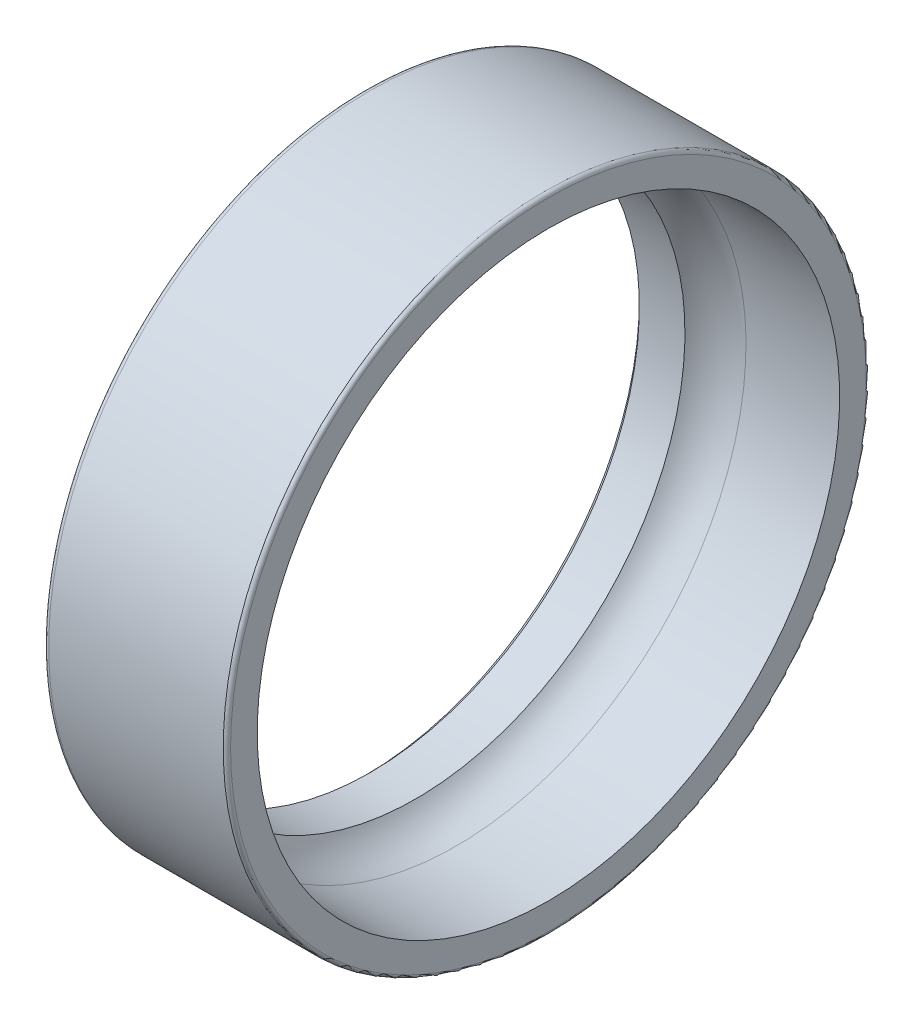
ISO-10303-21;
HEADER;
FILE_DESCRIPTION(('STEP AP214'),'2;1');
FILE_NAME('part.step','',(''),(''),'','','');
FILE_SCHEMA(('AUTOMOTIVE_DESIGN { 1 0 10303 214 1 1 1 1 }'));
ENDSEC;
DATA;
#1=APPLICATION_CONTEXT('core data for automotive mechanical design processes');
#2=APPLICATION_PROTOCOL_DEFINITION('international standard','automotive_design',2000,#1);
#3=PRODUCT_CONTEXT('',#1,'mechanical');
#4=PRODUCT('Part','Part','',(#3));
#5=PRODUCT_RELATED_PRODUCT_CATEGORY('part','',(#4));
#6=PRODUCT_DEFINITION_FORMATION('','',#4);
#7=PRODUCT_DEFINITION_CONTEXT('part definition',#1,'design');
#8=PRODUCT_DEFINITION('design','',#6,#7);
#9=PRODUCT_DEFINITION_SHAPE('','',#8);
#10=(LENGTH_UNIT() NAMED_UNIT(*) SI_UNIT(.MILLI.,.METRE.));
#11=(NAMED_UNIT(*) PLANE_ANGLE_UNIT() SI_UNIT($,.RADIAN.));
#12=(NAMED_UNIT(*) SI_UNIT($,.STERADIAN.) SOLID_ANGLE_UNIT());
#13=UNCERTAINTY_MEASURE_WITH_UNIT(LENGTH_MEASURE(1.E-05),#10,'distance_accuracy_value','');
#14=(GEOMETRIC_REPRESENTATION_CONTEXT(3) GLOBAL_UNCERTAINTY_ASSIGNED_CONTEXT((#13)) GLOBAL_UNIT_ASSIGNED_CONTEXT((#10,
#11,#12)) REPRESENTATION_CONTEXT('',''));
#15=CARTESIAN_POINT('',(0.,0.,0.));
#16=DIRECTION('',(0.,0.,1.));
#17=DIRECTION('',(1.,0.,0.));
#18=AXIS2_PLACEMENT_3D('',#15,#16,#17);
#19=CARTESIAN_POINT('',(0.,16.075,0.));
#20=DIRECTION('',(-1.,0.,0.));
#21=DIRECTION('',(0.,1.,0.));
#22=AXIS2_PLACEMENT_3D('',#19,#20,#21);
#23=PLANE('',#22);
#24=CARTESIAN_POINT('',(0.,0.,0.));
#25=DIRECTION('',(1.,0.,0.));
#26=DIRECTION('',(0.,1.,0.));
#27=AXIS2_PLACEMENT_3D('',#24,#25,#26);
#28=CIRCLE('',#27,14.95);
#29=CARTESIAN_POINT('',(0.,-14.95,0.));
#30=VERTEX_POINT('',#29);
#31=EDGE_CURVE('E86',#30,#30,#28,.T.);
#32=ORIENTED_EDGE('',*,*,#31,.T.);
#33=EDGE_LOOP('',(#32));
#34=FACE_BOUND('',#33,.T.);
#35=CARTESIAN_POINT('',(0.,0.,0.));
#36=DIRECTION('',(1.,0.,0.));
#37=DIRECTION('',(0.,1.,0.));
#38=AXIS2_PLACEMENT_3D('',#35,#36,#37);
#39=CIRCLE('',#38,17.2);
#40=CARTESIAN_POINT('',(0.,0.,17.2));
#41=VERTEX_POINT('',#40);
#42=EDGE_CURVE('E72',#41,#41,#39,.T.);
#43=ORIENTED_EDGE('',*,*,#42,.F.);
#44=EDGE_LOOP('',(#43));
#45=FACE_BOUND('',#44,.T.);
#46=ADVANCED_FACE('F17',(#34,#45),#23,.T.);
#47=CARTESIAN_POINT('',(10.,16.575,0.));
#48=DIRECTION('',(1.,0.,0.));
#49=DIRECTION('',(0.,1.,0.));
#50=AXIS2_PLACEMENT_3D('',#47,#48,#49);
#51=PLANE('',#50);
#52=CARTESIAN_POINT('',(10.,0.,0.));
#53=DIRECTION('',(1.,0.,0.));
#54=DIRECTION('',(0.,1.,0.));
#55=AXIS2_PLACEMENT_3D('',#52,#53,#54);
#56=CIRCLE('',#55,15.85);
#57=CARTESIAN_POINT('',(10.,-15.85,0.));
#58=VERTEX_POINT('',#57);
#59=EDGE_CURVE('E80',#58,#58,#56,.T.);
#60=ORIENTED_EDGE('',*,*,#59,.F.);
#61=EDGE_LOOP('',(#60));
#62=FACE_BOUND('',#61,.T.);
#63=CARTESIAN_POINT('',(10.,0.,0.));
#64=DIRECTION('',(1.,0.,0.));
#65=DIRECTION('',(0.,1.,0.));
#66=AXIS2_PLACEMENT_3D('',#63,#64,#65);
#67=CIRCLE('',#66,17.3);
#68=CARTESIAN_POINT('',(10.,0.,17.3));
#69=VERTEX_POINT('',#68);
#70=EDGE_CURVE('E27',#69,#69,#67,.T.);
#71=ORIENTED_EDGE('',*,*,#70,.T.);
#72=EDGE_LOOP('',(#71));
#73=FACE_BOUND('',#72,.T.);
#74=ADVANCED_FACE('F114',(#62,#73),#51,.T.);
#75=CARTESIAN_POINT('',(5.05,0.,0.));
#76=DIRECTION('',(1.,0.,0.));
#77=DIRECTION('',(0.,1.,0.));
#78=AXIS2_PLACEMENT_3D('',#75,#76,#77);
#79=CYLINDRICAL_SURFACE('',#78,17.5);
#80=CARTESIAN_POINT('',(0.3,0.,0.));
#81=DIRECTION('',(1.,0.,0.));
#82=DIRECTION('',(0.,1.,0.));
#83=AXIS2_PLACEMENT_3D('',#80,#81,#82);
#84=CIRCLE('',#83,17.5);
#85=CARTESIAN_POINT('',(0.3,-17.5,0.));
#86=VERTEX_POINT('',#85);
#87=EDGE_CURVE('E67',#86,#86,#84,.T.);
#88=ORIENTED_EDGE('',*,*,#87,.T.);
#89=EDGE_LOOP('',(#88));
#90=FACE_BOUND('',#89,.T.);
#91=CARTESIAN_POINT('',(9.8,0.,0.));
#92=DIRECTION('',(1.,0.,0.));
#93=DIRECTION('',(0.,1.,0.));
#94=AXIS2_PLACEMENT_3D('',#91,#92,#93);
#95=CIRCLE('',#94,17.5);
#96=CARTESIAN_POINT('',(9.8,-17.5,0.));
#97=VERTEX_POINT('',#96);
#98=EDGE_CURVE('E11',#97,#97,#95,.T.);
#99=ORIENTED_EDGE('',*,*,#98,.F.);
#100=EDGE_LOOP('',(#99));
#101=FACE_BOUND('',#100,.T.);
#102=ADVANCED_FACE('F68',(#90,#101),#79,.T.);
#103=CARTESIAN_POINT('',(9.8,0.,0.));
#104=DIRECTION('',(1.,0.,0.));
#105=DIRECTION('',(0.,0.,-1.));
#106=AXIS2_PLACEMENT_3D('',#103,#104,#105);
#107=TOROIDAL_SURFACE('',#106,17.3,0.2);
#108=ORIENTED_EDGE('',*,*,#98,.T.);
#109=EDGE_LOOP('',(#108));
#110=FACE_BOUND('',#109,.T.);
#111=ORIENTED_EDGE('',*,*,#70,.F.);
#112=EDGE_LOOP('',(#111));
#113=FACE_BOUND('',#112,.T.);
#114=ADVANCED_FACE('F109',(#110,#113),#107,.T.);
#115=CARTESIAN_POINT('',(7.48834401779462,0.,0.));
#116=DIRECTION('',(1.,0.,0.));
#117=DIRECTION('',(0.,1.,0.));
#118=AXIS2_PLACEMENT_3D('',#115,#116,#117);
#119=CONICAL_SURFACE('',#118,15.8138562022594,0.0143894320593544);
#120=CARTESIAN_POINT('',(4.97668803558923,0.,0.));
#121=DIRECTION('',(1.,0.,0.));
#122=DIRECTION('',(0.,1.,0.));
#123=AXIS2_PLACEMENT_3D('',#120,#121,#122);
#124=CIRCLE('',#123,15.7777124045187);
#125=CARTESIAN_POINT('',(4.97668803558923,15.7777124045187,0.));
#126=VERTEX_POINT('',#125);
#127=EDGE_CURVE('E82',#126,#126,#124,.T.);
#128=ORIENTED_EDGE('',*,*,#127,.F.);
#129=EDGE_LOOP('',(#128));
#130=FACE_BOUND('',#129,.T.);
#131=ORIENTED_EDGE('',*,*,#59,.T.);
#132=EDGE_LOOP('',(#131));
#133=FACE_BOUND('',#132,.T.);
#134=ADVANCED_FACE('F98',(#130,#133),#119,.F.);
#135=CARTESIAN_POINT('',(5.0166604983954,0.,0.));
#136=DIRECTION('',(1.,0.,0.));
#137=DIRECTION('',(0.,0.,-1.));
#138=AXIS2_PLACEMENT_3D('',#135,#136,#137);
#139=TOROIDAL_SURFACE('',#138,13.,2.778);
#140=ORIENTED_EDGE('',*,*,#127,.T.);
#141=EDGE_LOOP('',(#140));
#142=FACE_BOUND('',#141,.T.);
#143=CARTESIAN_POINT('',(2.7817591582911,0.,0.));
#144=DIRECTION('',(1.,0.,0.));
#145=DIRECTION('',(0.,1.,0.));
#146=AXIS2_PLACEMENT_3D('',#143,#144,#145);
#147=CIRCLE('',#146,14.65);
#148=CARTESIAN_POINT('',(2.7817591582911,0.,14.65));
#149=VERTEX_POINT('',#148);
#150=EDGE_CURVE('E85',#149,#149,#147,.T.);
#151=ORIENTED_EDGE('',*,*,#150,.F.);
#152=EDGE_LOOP('',(#151));
#153=FACE_BOUND('',#152,.T.);
#154=ADVANCED_FACE('F96',(#142,#153),#139,.F.);
#155=CARTESIAN_POINT('',(1.54087957914555,0.,0.));
#156=DIRECTION('',(1.,0.,0.));
#157=DIRECTION('',(0.,1.,0.));
#158=AXIS2_PLACEMENT_3D('',#155,#156,#157);
#159=CYLINDRICAL_SURFACE('',#158,14.65);
#160=CARTESIAN_POINT('',(0.3,0.,0.));
#161=DIRECTION('',(1.,0.,0.));
#162=DIRECTION('',(0.,1.,0.));
#163=AXIS2_PLACEMENT_3D('',#160,#161,#162);
#164=CIRCLE('',#163,14.65);
#165=CARTESIAN_POINT('',(0.3,-14.65,0.));
#166=VERTEX_POINT('',#165);
#167=EDGE_CURVE('E20',#166,#166,#164,.T.);
#168=ORIENTED_EDGE('',*,*,#167,.F.);
#169=EDGE_LOOP('',(#168));
#170=FACE_BOUND('',#169,.T.);
#171=ORIENTED_EDGE('',*,*,#150,.T.);
#172=EDGE_LOOP('',(#171));
#173=FACE_BOUND('',#172,.T.);
#174=ADVANCED_FACE('F94',(#170,#173),#159,.F.);
#175=CARTESIAN_POINT('',(0.15,0.,0.));
#176=DIRECTION('',(-1.,0.,0.));
#177=DIRECTION('',(0.,1.,0.));
#178=AXIS2_PLACEMENT_3D('',#175,#176,#177);
#179=CONICAL_SURFACE('',#178,14.8,0.785398163397447);
#180=ORIENTED_EDGE('',*,*,#31,.F.);
#181=EDGE_LOOP('',(#180));
#182=FACE_BOUND('',#181,.T.);
#183=ORIENTED_EDGE('',*,*,#167,.T.);
#184=EDGE_LOOP('',(#183));
#185=FACE_BOUND('',#184,.T.);
#186=ADVANCED_FACE('F106',(#182,#185),#179,.F.);
#187=CARTESIAN_POINT('',(0.3,0.,0.));
#188=DIRECTION('',(1.,0.,0.));
#189=DIRECTION('',(0.,0.,-1.));
#190=AXIS2_PLACEMENT_3D('',#187,#188,#189);
#191=TOROIDAL_SURFACE('',#190,17.2,0.3);
#192=ORIENTED_EDGE('',*,*,#42,.T.);
#193=EDGE_LOOP('',(#192));
#194=FACE_BOUND('',#193,.T.);
#195=ORIENTED_EDGE('',*,*,#87,.F.);
#196=EDGE_LOOP('',(#195));
#197=FACE_BOUND('',#196,.T.);
#198=ADVANCED_FACE('F125',(#194,#197),#191,.T.);
#199=CLOSED_SHELL('',(#46,#74,#102,#114,#134,#154,#174,#186,#198));
#200=MANIFOLD_SOLID_BREP('B1',#199);
#201=ADVANCED_BREP_SHAPE_REPRESENTATION('',(#18,#200),#14);
#202=SHAPE_DEFINITION_REPRESENTATION(#9,#201);
ENDSEC;
END-ISO-10303-21;
